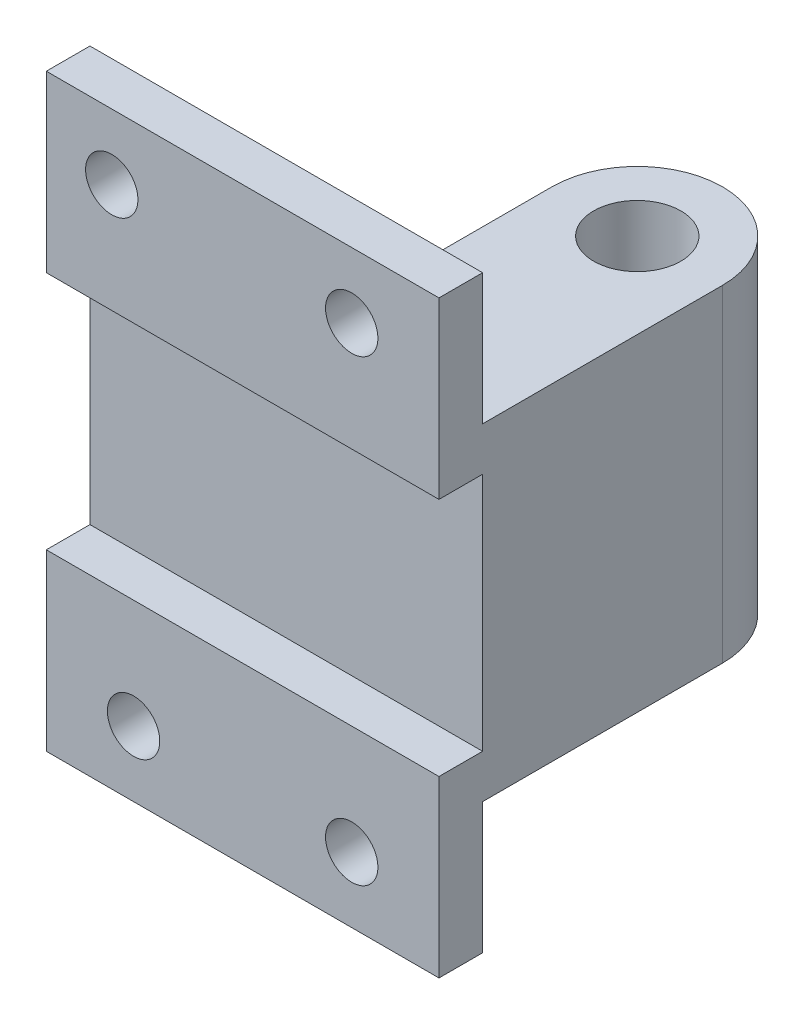
ISO-10303-21;
HEADER;
FILE_DESCRIPTION(('STEP AP214'),'2;1');
FILE_NAME('part.step','',(''),(''),'','','');
FILE_SCHEMA(('AUTOMOTIVE_DESIGN { 1 0 10303 214 1 1 1 1 }'));
ENDSEC;
DATA;
#1=APPLICATION_CONTEXT('core data for automotive mechanical design processes');
#2=APPLICATION_PROTOCOL_DEFINITION('international standard','automotive_design',2000,#1);
#3=PRODUCT_CONTEXT('',#1,'mechanical');
#4=PRODUCT('Part','Part','',(#3));
#5=PRODUCT_RELATED_PRODUCT_CATEGORY('part','',(#4));
#6=PRODUCT_DEFINITION_FORMATION('','',#4);
#7=PRODUCT_DEFINITION_CONTEXT('part definition',#1,'design');
#8=PRODUCT_DEFINITION('design','',#6,#7);
#9=PRODUCT_DEFINITION_SHAPE('','',#8);
#10=(LENGTH_UNIT() NAMED_UNIT(*) SI_UNIT(.MILLI.,.METRE.));
#11=(NAMED_UNIT(*) PLANE_ANGLE_UNIT() SI_UNIT($,.RADIAN.));
#12=(NAMED_UNIT(*) SI_UNIT($,.STERADIAN.) SOLID_ANGLE_UNIT());
#13=UNCERTAINTY_MEASURE_WITH_UNIT(LENGTH_MEASURE(1.E-05),#10,'distance_accuracy_value','');
#14=(GEOMETRIC_REPRESENTATION_CONTEXT(3) GLOBAL_UNCERTAINTY_ASSIGNED_CONTEXT((#13)) GLOBAL_UNIT_ASSIGNED_CONTEXT((#10,
#11,#12)) REPRESENTATION_CONTEXT('',''));
#15=CARTESIAN_POINT('',(0.,0.,0.));
#16=DIRECTION('',(0.,0.,1.));
#17=DIRECTION('',(1.,0.,0.));
#18=AXIS2_PLACEMENT_3D('',#15,#16,#17);
#19=CARTESIAN_POINT('',(50.0907088961746,73.,-21.471886497153));
#20=DIRECTION('',(-1.,0.,0.));
#21=DIRECTION('',(0.,0.,1.));
#22=AXIS2_PLACEMENT_3D('',#19,#20,#21);
#23=PLANE('',#22);
#24=DIRECTION('',(0.,0.,-1.));
#25=VECTOR('',#24,1.);
#26=CARTESIAN_POINT('',(50.0907088961746,67.,-21.471886497153));
#27=LINE('',#26,#25);
#28=CARTESIAN_POINT('',(50.0907088961746,67.,-20.));
#29=VERTEX_POINT('',#28);
#30=CARTESIAN_POINT('',(50.0907088961746,67.,-65.894352205504));
#31=VERTEX_POINT('',#30);
#32=EDGE_CURVE('E272',#29,#31,#27,.T.);
#33=ORIENTED_EDGE('',*,*,#32,.T.);
#34=DIRECTION('',(0.,-1.,0.));
#35=VECTOR('',#34,1.);
#36=CARTESIAN_POINT('',(50.0907088961746,73.,-65.894352205504));
#37=LINE('',#36,#35);
#38=CARTESIAN_POINT('',(50.0907088961746,73.,-65.894352205504));
#39=VERTEX_POINT('',#38);
#40=EDGE_CURVE('E44',#39,#31,#37,.T.);
#41=ORIENTED_EDGE('',*,*,#40,.F.);
#42=DIRECTION('',(0.,0.,-1.));
#43=VECTOR('',#42,1.);
#44=CARTESIAN_POINT('',(50.0907088961746,73.,-21.471886497153));
#45=LINE('',#44,#43);
#46=CARTESIAN_POINT('',(50.0907088961746,73.,-20.));
#47=VERTEX_POINT('',#46);
#48=EDGE_CURVE('E282',#47,#39,#45,.T.);
#49=ORIENTED_EDGE('',*,*,#48,.F.);
#50=DIRECTION('',(0.,-1.,0.));
#51=VECTOR('',#50,1.);
#52=CARTESIAN_POINT('',(50.0907088961746,73.,-20.));
#53=LINE('',#52,#51);
#54=EDGE_CURVE('E276',#47,#29,#53,.T.);
#55=ORIENTED_EDGE('',*,*,#54,.T.);
#56=EDGE_LOOP('',(#33,#41,#49,#55));
#57=FACE_BOUND('',#56,.T.);
#58=ADVANCED_FACE('F37',(#57),#23,.F.);
#59=CARTESIAN_POINT('',(65.7643904962565,73.,-65.894352205504));
#60=DIRECTION('',(0.,-1.,0.));
#61=DIRECTION('',(0.,0.,-1.));
#62=AXIS2_PLACEMENT_3D('',#59,#60,#61);
#63=PLANE('',#62);
#64=DIRECTION('',(-0.727333325582508,0.,0.686284367807609));
#65=VECTOR('',#64,1.);
#66=CARTESIAN_POINT('',(55.0399108357266,73.,-77.2602987759523));
#67=LINE('',#66,#65);
#68=CARTESIAN_POINT('',(54.159540176039,73.,-76.4296141360919));
#69=VERTEX_POINT('',#68);
#70=CARTESIAN_POINT('',(0.,73.,-25.3267092049918));
#71=VERTEX_POINT('',#70);
#72=EDGE_CURVE('E278',#69,#71,#67,.T.);
#73=ORIENTED_EDGE('',*,*,#72,.T.);
#74=DIRECTION('',(0.,0.,-1.));
#75=VECTOR('',#74,1.);
#76=CARTESIAN_POINT('',(0.,73.,-20.));
#77=LINE('',#76,#75);
#78=CARTESIAN_POINT('',(0.,73.,-20.));
#79=VERTEX_POINT('',#78);
#80=EDGE_CURVE('E51',#79,#71,#77,.T.);
#81=ORIENTED_EDGE('',*,*,#80,.F.);
#82=DIRECTION('',(-1.,0.,0.));
#83=VECTOR('',#82,1.);
#84=CARTESIAN_POINT('',(0.,73.,-20.));
#85=LINE('',#84,#83);
#86=EDGE_CURVE('E290',#47,#79,#85,.T.);
#87=ORIENTED_EDGE('',*,*,#86,.F.);
#88=ORIENTED_EDGE('',*,*,#48,.T.);
#89=CARTESIAN_POINT('',(65.7643904962565,73.,-65.894352205504));
#90=DIRECTION('',(0.,-1.,0.));
#91=DIRECTION('',(0.,0.,-1.));
#92=AXIS2_PLACEMENT_3D('',#89,#90,#91);
#93=CIRCLE('',#92,15.6736816000819);
#94=EDGE_CURVE('E281',#39,#69,#93,.T.);
#95=ORIENTED_EDGE('',*,*,#94,.T.);
#96=EDGE_LOOP('',(#73,#81,#87,#88,#95));
#97=FACE_BOUND('',#96,.T.);
#98=ADVANCED_FACE('F264',(#97),#63,.F.);
#99=CARTESIAN_POINT('',(65.7643904962565,67.,-65.894352205504));
#100=DIRECTION('',(0.,-1.,0.));
#101=DIRECTION('',(0.,0.,-1.));
#102=AXIS2_PLACEMENT_3D('',#99,#100,#101);
#103=PLANE('',#102);
#104=DIRECTION('',(0.,0.,-1.));
#105=VECTOR('',#104,1.);
#106=CARTESIAN_POINT('',(0.,67.,-20.));
#107=LINE('',#106,#105);
#108=CARTESIAN_POINT('',(0.,67.,-20.));
#109=VERTEX_POINT('',#108);
#110=CARTESIAN_POINT('',(0.,67.,-25.3267092049918));
#111=VERTEX_POINT('',#110);
#112=EDGE_CURVE('E236',#109,#111,#107,.T.);
#113=ORIENTED_EDGE('',*,*,#112,.T.);
#114=DIRECTION('',(-0.727333325582508,0.,0.686284367807609));
#115=VECTOR('',#114,1.);
#116=CARTESIAN_POINT('',(55.0399108357266,67.,-77.2602987759523));
#117=LINE('',#116,#115);
#118=CARTESIAN_POINT('',(54.159540176039,67.,-76.4296141360918));
#119=VERTEX_POINT('',#118);
#120=EDGE_CURVE('E11',#119,#111,#117,.T.);
#121=ORIENTED_EDGE('',*,*,#120,.F.);
#122=CARTESIAN_POINT('',(65.7643904962565,67.,-65.894352205504));
#123=DIRECTION('',(0.,-1.,0.));
#124=DIRECTION('',(0.,0.,-1.));
#125=AXIS2_PLACEMENT_3D('',#122,#123,#124);
#126=CIRCLE('',#125,15.6736816000819);
#127=EDGE_CURVE('E277',#31,#119,#126,.T.);
#128=ORIENTED_EDGE('',*,*,#127,.F.);
#129=ORIENTED_EDGE('',*,*,#32,.F.);
#130=DIRECTION('',(-1.,0.,0.));
#131=VECTOR('',#130,1.);
#132=CARTESIAN_POINT('',(0.,67.,-20.));
#133=LINE('',#132,#131);
#134=EDGE_CURVE('E241',#29,#109,#133,.T.);
#135=ORIENTED_EDGE('',*,*,#134,.T.);
#136=EDGE_LOOP('',(#113,#121,#128,#129,#135));
#137=FACE_BOUND('',#136,.T.);
#138=ADVANCED_FACE('F237',(#137),#103,.T.);
#139=CARTESIAN_POINT('',(65.7643904962565,73.,-65.894352205504));
#140=DIRECTION('',(0.,-1.,0.));
#141=DIRECTION('',(0.,0.,-1.));
#142=AXIS2_PLACEMENT_3D('',#139,#140,#141);
#143=CYLINDRICAL_SURFACE('',#142,15.6736816000819);
#144=ORIENTED_EDGE('',*,*,#127,.T.);
#145=DIRECTION('',(0.,-1.,0.));
#146=VECTOR('',#145,1.);
#147=CARTESIAN_POINT('',(54.159540176039,73.,-76.4296141360919));
#148=LINE('',#147,#146);
#149=EDGE_CURVE('E58',#119,#69,#148,.F.);
#150=ORIENTED_EDGE('',*,*,#149,.T.);
#151=ORIENTED_EDGE('',*,*,#94,.F.);
#152=ORIENTED_EDGE('',*,*,#40,.T.);
#153=EDGE_LOOP('',(#144,#150,#151,#152));
#154=FACE_BOUND('',#153,.T.);
#155=ADVANCED_FACE('F253',(#154),#143,.F.);
#156=CARTESIAN_POINT('',(55.9202814954141,85.,-78.0909834158128));
#157=DIRECTION('',(0.686284367807609,0.,0.727333325582508));
#158=DIRECTION('',(0.727333325582508,0.,-0.686284367807609));
#159=AXIS2_PLACEMENT_3D('',#156,#157,#158);
#160=PLANE('',#159);
#161=ORIENTED_EDGE('',*,*,#120,.T.);
#162=DIRECTION('',(0.,-1.,0.));
#163=VECTOR('',#162,1.);
#164=CARTESIAN_POINT('',(0.,73.,-25.3267092049918));
#165=LINE('',#164,#163);
#166=EDGE_CURVE('E246',#71,#111,#165,.T.);
#167=ORIENTED_EDGE('',*,*,#166,.F.);
#168=ORIENTED_EDGE('',*,*,#72,.F.);
#169=ORIENTED_EDGE('',*,*,#149,.F.);
#170=EDGE_LOOP('',(#161,#167,#168,#169));
#171=FACE_BOUND('',#170,.T.);
#172=ADVANCED_FACE('F251',(#171),#160,.F.);
#173=CARTESIAN_POINT('',(0.,73.,-20.));
#174=DIRECTION('',(-1.,0.,0.));
#175=DIRECTION('',(0.,0.,1.));
#176=AXIS2_PLACEMENT_3D('',#173,#174,#175);
#177=PLANE('',#176);
#178=DIRECTION('',(0.,1.,0.));
#179=VECTOR('',#178,1.);
#180=CARTESIAN_POINT('',(0.,105.,-20.));
#181=LINE('',#180,#179);
#182=CARTESIAN_POINT('',(0.,105.,-20.));
#183=VERTEX_POINT('',#182);
#184=EDGE_CURVE('E434',#79,#183,#181,.T.);
#185=ORIENTED_EDGE('',*,*,#184,.F.);
#186=ORIENTED_EDGE('',*,*,#80,.T.);
#187=ORIENTED_EDGE('',*,*,#166,.T.);
#188=ORIENTED_EDGE('',*,*,#112,.F.);
#189=CARTESIAN_POINT('',(0.,30.,-20.));
#190=VERTEX_POINT('',#189);
#191=EDGE_CURVE('E400',#190,#109,#181,.T.);
#192=ORIENTED_EDGE('',*,*,#191,.F.);
#193=DIRECTION('',(0.,0.,-1.));
#194=VECTOR('',#193,1.);
#195=CARTESIAN_POINT('',(0.,30.,-20.));
#196=LINE('',#195,#194);
#197=CARTESIAN_POINT('',(0.,30.,-10.));
#198=VERTEX_POINT('',#197);
#199=EDGE_CURVE('E429',#198,#190,#196,.T.);
#200=ORIENTED_EDGE('',*,*,#199,.F.);
#201=DIRECTION('',(0.,-1.,0.));
#202=VECTOR('',#201,1.);
#203=CARTESIAN_POINT('',(0.,135.,-10.));
#204=LINE('',#203,#202);
#205=CARTESIAN_POINT('',(0.,0.,-10.));
#206=VERTEX_POINT('',#205);
#207=EDGE_CURVE('E461',#198,#206,#204,.T.);
#208=ORIENTED_EDGE('',*,*,#207,.T.);
#209=DIRECTION('',(0.,0.,1.));
#210=VECTOR('',#209,1.);
#211=CARTESIAN_POINT('',(0.,0.,0.));
#212=LINE('',#211,#210);
#213=CARTESIAN_POINT('',(0.,0.,0.));
#214=VERTEX_POINT('',#213);
#215=EDGE_CURVE('E411',#206,#214,#212,.T.);
#216=ORIENTED_EDGE('',*,*,#215,.T.);
#217=DIRECTION('',(0.,-1.,0.));
#218=VECTOR('',#217,1.);
#219=CARTESIAN_POINT('',(0.,135.,0.));
#220=LINE('',#219,#218);
#221=CARTESIAN_POINT('',(0.,40.,0.));
#222=VERTEX_POINT('',#221);
#223=EDGE_CURVE('E418',#222,#214,#220,.T.);
#224=ORIENTED_EDGE('',*,*,#223,.F.);
#225=DIRECTION('',(0.,0.,-1.));
#226=VECTOR('',#225,1.);
#227=CARTESIAN_POINT('',(0.,40.,0.));
#228=LINE('',#227,#226);
#229=CARTESIAN_POINT('',(0.,40.,-10.));
#230=VERTEX_POINT('',#229);
#231=EDGE_CURVE('E408',#222,#230,#228,.T.);
#232=ORIENTED_EDGE('',*,*,#231,.T.);
#233=DIRECTION('',(0.,1.,0.));
#234=VECTOR('',#233,1.);
#235=CARTESIAN_POINT('',(0.,0.,-10.));
#236=LINE('',#235,#234);
#237=CARTESIAN_POINT('',(0.,95.,-10.));
#238=VERTEX_POINT('',#237);
#239=EDGE_CURVE('E361',#230,#238,#236,.T.);
#240=ORIENTED_EDGE('',*,*,#239,.T.);
#241=DIRECTION('',(0.,0.,1.));
#242=VECTOR('',#241,1.);
#243=CARTESIAN_POINT('',(0.,95.,0.));
#244=LINE('',#243,#242);
#245=CARTESIAN_POINT('',(0.,95.,0.));
#246=VERTEX_POINT('',#245);
#247=EDGE_CURVE('E401',#238,#246,#244,.T.);
#248=ORIENTED_EDGE('',*,*,#247,.T.);
#249=CARTESIAN_POINT('',(0.,135.,0.));
#250=VERTEX_POINT('',#249);
#251=EDGE_CURVE('E357',#250,#246,#220,.T.);
#252=ORIENTED_EDGE('',*,*,#251,.F.);
#253=DIRECTION('',(0.,0.,1.));
#254=VECTOR('',#253,1.);
#255=CARTESIAN_POINT('',(0.,135.,0.));
#256=LINE('',#255,#254);
#257=CARTESIAN_POINT('',(0.,135.,-10.));
#258=VERTEX_POINT('',#257);
#259=EDGE_CURVE('E450',#258,#250,#256,.T.);
#260=ORIENTED_EDGE('',*,*,#259,.F.);
#261=CARTESIAN_POINT('',(0.,105.,-10.));
#262=VERTEX_POINT('',#261);
#263=EDGE_CURVE('E404',#258,#262,#204,.T.);
#264=ORIENTED_EDGE('',*,*,#263,.T.);
#265=DIRECTION('',(0.,0.,1.));
#266=VECTOR('',#265,1.);
#267=CARTESIAN_POINT('',(0.,105.,-10.));
#268=LINE('',#267,#266);
#269=EDGE_CURVE('E383',#183,#262,#268,.T.);
#270=ORIENTED_EDGE('',*,*,#269,.F.);
#271=EDGE_LOOP('',(#185,#186,#187,#188,#192,#200,#208,#216,#224,#232,#240,#248,#252,#260,#264,#270));
#272=FACE_BOUND('',#271,.T.);
#273=ADVANCED_FACE('F247',(#272),#177,.T.);
#274=CARTESIAN_POINT('',(90.,105.,-20.));
#275=DIRECTION('',(0.,0.,1.));
#276=DIRECTION('',(0.,-1.,0.));
#277=AXIS2_PLACEMENT_3D('',#274,#275,#276);
#278=PLANE('',#277);
#279=ORIENTED_EDGE('',*,*,#54,.F.);
#280=ORIENTED_EDGE('',*,*,#86,.T.);
#281=ORIENTED_EDGE('',*,*,#184,.T.);
#282=DIRECTION('',(-1.,0.,0.));
#283=VECTOR('',#282,1.);
#284=CARTESIAN_POINT('',(90.,105.,-20.));
#285=LINE('',#284,#283);
#286=CARTESIAN_POINT('',(39.,105.,-20.));
#287=VERTEX_POINT('',#286);
#288=EDGE_CURVE('E380',#287,#183,#285,.T.);
#289=ORIENTED_EDGE('',*,*,#288,.F.);
#290=DIRECTION('',(-1.,0.,0.));
#291=VECTOR('',#290,1.);
#292=CARTESIAN_POINT('',(69.,105.,-20.));
#293=LINE('',#292,#291);
#294=CARTESIAN_POINT('',(45.,105.,-20.));
#295=VERTEX_POINT('',#294);
#296=EDGE_CURVE('E508',#295,#287,#293,.T.);
#297=ORIENTED_EDGE('',*,*,#296,.F.);
#298=CARTESIAN_POINT('',(50.8916646431351,105.,-20.));
#299=VERTEX_POINT('',#298);
#300=EDGE_CURVE('E442',#299,#295,#285,.T.);
#301=ORIENTED_EDGE('',*,*,#300,.F.);
#302=DIRECTION('',(0.,-1.,0.));
#303=VECTOR('',#302,1.);
#304=CARTESIAN_POINT('',(50.8916646431351,105.,-20.));
#305=LINE('',#304,#303);
#306=CARTESIAN_POINT('',(50.8916646431351,30.,-20.));
#307=VERTEX_POINT('',#306);
#308=EDGE_CURVE('E396',#299,#307,#305,.T.);
#309=ORIENTED_EDGE('',*,*,#308,.T.);
#310=DIRECTION('',(-1.,0.,0.));
#311=VECTOR('',#310,1.);
#312=CARTESIAN_POINT('',(90.,30.,-20.));
#313=LINE('',#312,#311);
#314=CARTESIAN_POINT('',(45.,30.,-20.));
#315=VERTEX_POINT('',#314);
#316=EDGE_CURVE('E325',#307,#315,#313,.T.);
#317=ORIENTED_EDGE('',*,*,#316,.T.);
#318=DIRECTION('',(-1.,0.,0.));
#319=VECTOR('',#318,1.);
#320=CARTESIAN_POINT('',(69.,30.,-20.));
#321=LINE('',#320,#319);
#322=CARTESIAN_POINT('',(39.,30.,-20.));
#323=VERTEX_POINT('',#322);
#324=EDGE_CURVE('E321',#315,#323,#321,.T.);
#325=ORIENTED_EDGE('',*,*,#324,.T.);
#326=EDGE_CURVE('E324',#323,#190,#313,.T.);
#327=ORIENTED_EDGE('',*,*,#326,.T.);
#328=ORIENTED_EDGE('',*,*,#191,.T.);
#329=ORIENTED_EDGE('',*,*,#134,.F.);
#330=EDGE_LOOP('',(#279,#280,#281,#289,#297,#301,#309,#317,#325,#327,#328,#329));
#331=FACE_BOUND('',#330,.T.);
#332=ADVANCED_FACE('F259',(#331),#278,.F.);
#333=CARTESIAN_POINT('',(0.,135.,-10.));
#334=DIRECTION('',(0.,0.,1.));
#335=DIRECTION('',(1.,0.,0.));
#336=AXIS2_PLACEMENT_3D('',#333,#334,#335);
#337=PLANE('',#336);
#338=CARTESIAN_POINT('',(15.,120.,-10.));
#339=DIRECTION('',(0.,0.,-1.));
#340=DIRECTION('',(-1.,0.,0.));
#341=AXIS2_PLACEMENT_3D('',#338,#339,#340);
#342=CIRCLE('',#341,6.);
#343=CARTESIAN_POINT('',(8.99999999999999,120.,-10.));
#344=VERTEX_POINT('',#343);
#345=EDGE_CURVE('E350',#344,#344,#342,.T.);
#346=ORIENTED_EDGE('',*,*,#345,.F.);
#347=EDGE_LOOP('',(#346));
#348=FACE_BOUND('',#347,.T.);
#349=DIRECTION('',(0.,-1.,0.));
#350=VECTOR('',#349,1.);
#351=CARTESIAN_POINT('',(39.,135.,-10.));
#352=LINE('',#351,#350);
#353=CARTESIAN_POINT('',(39.,135.,-10.));
#354=VERTEX_POINT('',#353);
#355=CARTESIAN_POINT('',(39.,105.,-10.));
#356=VERTEX_POINT('',#355);
#357=EDGE_CURVE('E310',#354,#356,#352,.T.);
#358=ORIENTED_EDGE('',*,*,#357,.T.);
#359=DIRECTION('',(-1.,0.,0.));
#360=VECTOR('',#359,1.);
#361=CARTESIAN_POINT('',(90.,105.,-10.));
#362=LINE('',#361,#360);
#363=EDGE_CURVE('E441',#356,#262,#362,.T.);
#364=ORIENTED_EDGE('',*,*,#363,.T.);
#365=ORIENTED_EDGE('',*,*,#263,.F.);
#366=DIRECTION('',(-1.,0.,0.));
#367=VECTOR('',#366,1.);
#368=CARTESIAN_POINT('',(0.,135.,-10.));
#369=LINE('',#368,#367);
#370=EDGE_CURVE('E457',#354,#258,#369,.T.);
#371=ORIENTED_EDGE('',*,*,#370,.F.);
#372=EDGE_LOOP('',(#358,#364,#365,#371));
#373=FACE_BOUND('',#372,.T.);
#374=ADVANCED_FACE('F526',(#348,#373),#337,.F.);
#375=CARTESIAN_POINT('',(70.,120.,-10.));
#376=DIRECTION('',(0.,0.,-1.));
#377=DIRECTION('',(-1.,0.,0.));
#378=AXIS2_PLACEMENT_3D('',#375,#376,#377);
#379=CIRCLE('',#378,6.);
#380=CARTESIAN_POINT('',(64.,120.,-10.));
#381=VERTEX_POINT('',#380);
#382=EDGE_CURVE('E341',#381,#381,#379,.T.);
#383=ORIENTED_EDGE('',*,*,#382,.F.);
#384=EDGE_LOOP('',(#383));
#385=FACE_BOUND('',#384,.T.);
#386=DIRECTION('',(0.,-1.,0.));
#387=VECTOR('',#386,1.);
#388=CARTESIAN_POINT('',(45.,135.,-10.));
#389=LINE('',#388,#387);
#390=CARTESIAN_POINT('',(45.,135.,-10.));
#391=VERTEX_POINT('',#390);
#392=CARTESIAN_POINT('',(45.,105.,-10.));
#393=VERTEX_POINT('',#392);
#394=EDGE_CURVE('E498',#391,#393,#389,.T.);
#395=ORIENTED_EDGE('',*,*,#394,.F.);
#396=CARTESIAN_POINT('',(90.,135.,-10.));
#397=VERTEX_POINT('',#396);
#398=EDGE_CURVE('E447',#397,#391,#369,.T.);
#399=ORIENTED_EDGE('',*,*,#398,.F.);
#400=DIRECTION('',(0.,-1.,0.));
#401=VECTOR('',#400,1.);
#402=CARTESIAN_POINT('',(90.,135.,-10.));
#403=LINE('',#402,#401);
#404=CARTESIAN_POINT('',(90.,105.,-10.));
#405=VERTEX_POINT('',#404);
#406=EDGE_CURVE('E440',#397,#405,#403,.T.);
#407=ORIENTED_EDGE('',*,*,#406,.T.);
#408=EDGE_CURVE('E437',#405,#393,#362,.T.);
#409=ORIENTED_EDGE('',*,*,#408,.T.);
#410=EDGE_LOOP('',(#395,#399,#407,#409));
#411=FACE_BOUND('',#410,.T.);
#412=ADVANCED_FACE('F549',(#385,#411),#337,.F.);
#413=CARTESIAN_POINT('',(90.,105.,-10.));
#414=DIRECTION('',(0.,-1.,0.));
#415=DIRECTION('',(0.,0.,-1.));
#416=AXIS2_PLACEMENT_3D('',#413,#414,#415);
#417=PLANE('',#416);
#418=DIRECTION('',(0.,0.,1.));
#419=VECTOR('',#418,1.);
#420=CARTESIAN_POINT('',(39.,105.,-20.));
#421=LINE('',#420,#419);
#422=EDGE_CURVE('E504',#287,#356,#421,.T.);
#423=ORIENTED_EDGE('',*,*,#422,.F.);
#424=ORIENTED_EDGE('',*,*,#288,.T.);
#425=ORIENTED_EDGE('',*,*,#269,.T.);
#426=ORIENTED_EDGE('',*,*,#363,.F.);
#427=EDGE_LOOP('',(#423,#424,#425,#426));
#428=FACE_BOUND('',#427,.T.);
#429=ADVANCED_FACE('F533',(#428),#417,.F.);
#430=DIRECTION('',(0.,0.,1.));
#431=VECTOR('',#430,1.);
#432=CARTESIAN_POINT('',(50.8916646431351,105.,-65.));
#433=LINE('',#432,#431);
#434=CARTESIAN_POINT('',(50.8916646431351,105.,-65.));
#435=VERTEX_POINT('',#434);
#436=EDGE_CURVE('E378',#435,#299,#433,.T.);
#437=ORIENTED_EDGE('',*,*,#436,.T.);
#438=ORIENTED_EDGE('',*,*,#300,.T.);
#439=DIRECTION('',(0.,0.,-1.));
#440=VECTOR('',#439,1.);
#441=CARTESIAN_POINT('',(45.,105.,-20.));
#442=LINE('',#441,#440);
#443=EDGE_CURVE('E501',#393,#295,#442,.T.);
#444=ORIENTED_EDGE('',*,*,#443,.F.);
#445=ORIENTED_EDGE('',*,*,#408,.F.);
#446=DIRECTION('',(0.,0.,1.));
#447=VECTOR('',#446,1.);
#448=CARTESIAN_POINT('',(90.,105.,-10.));
#449=LINE('',#448,#447);
#450=CARTESIAN_POINT('',(90.,105.,-65.));
#451=VERTEX_POINT('',#450);
#452=EDGE_CURVE('E425',#451,#405,#449,.T.);
#453=ORIENTED_EDGE('',*,*,#452,.F.);
#454=CARTESIAN_POINT('',(70.4458323215675,105.,-65.));
#455=DIRECTION('',(0.,1.,0.));
#456=DIRECTION('',(0.,0.,1.));
#457=AXIS2_PLACEMENT_3D('',#454,#455,#456);
#458=CIRCLE('',#457,19.5541676784325);
#459=EDGE_CURVE('E381',#451,#435,#458,.T.);
#460=ORIENTED_EDGE('',*,*,#459,.T.);
#461=EDGE_LOOP('',(#437,#438,#444,#445,#453,#460));
#462=FACE_BOUND('',#461,.T.);
#463=CARTESIAN_POINT('',(70.4458323215675,105.,-65.));
#464=DIRECTION('',(0.,-1.,0.));
#465=DIRECTION('',(0.,0.,-1.));
#466=AXIS2_PLACEMENT_3D('',#463,#464,#465);
#467=CIRCLE('',#466,9.99999999999999);
#468=CARTESIAN_POINT('',(70.4458323215675,105.,-75.));
#469=VERTEX_POINT('',#468);
#470=EDGE_CURVE('E399',#469,#469,#467,.T.);
#471=ORIENTED_EDGE('',*,*,#470,.T.);
#472=EDGE_LOOP('',(#471));
#473=FACE_BOUND('',#472,.T.);
#474=ADVANCED_FACE('F555',(#462,#473),#417,.F.);
#475=CARTESIAN_POINT('',(65.7643904962565,73.,-65.894352205504));
#476=DIRECTION('',(0.,-1.,0.));
#477=DIRECTION('',(0.,0.,-1.));
#478=AXIS2_PLACEMENT_3D('',#475,#476,#477);
#479=PLANE('',#478);
#480=DIRECTION('',(-1.,0.,0.));
#481=VECTOR('',#480,1.);
#482=CARTESIAN_POINT('',(56.5789310412015,73.,-78.5944163588965));
#483=LINE('',#482,#481);
#484=CARTESIAN_POINT('',(56.3903238833352,73.,-78.5944163588965));
#485=VERTEX_POINT('',#484);
#486=CARTESIAN_POINT('',(55.9202814954141,73.,-78.5944163588965));
#487=VERTEX_POINT('',#486);
#488=EDGE_CURVE('E307',#485,#487,#483,.T.);
#489=ORIENTED_EDGE('',*,*,#488,.T.);
#490=DIRECTION('',(0.,0.,1.));
#491=VECTOR('',#490,1.);
#492=CARTESIAN_POINT('',(55.9202814954141,73.,-65.894352205504));
#493=LINE('',#492,#491);
#494=CARTESIAN_POINT('',(55.9202814954141,73.,-78.0909834158128));
#495=VERTEX_POINT('',#494);
#496=EDGE_CURVE('E303',#487,#495,#493,.T.);
#497=ORIENTED_EDGE('',*,*,#496,.T.);
#498=CARTESIAN_POINT('',(70.4458323215675,73.,-65.));
#499=DIRECTION('',(0.,-1.,0.));
#500=DIRECTION('',(0.,0.,-1.));
#501=AXIS2_PLACEMENT_3D('',#498,#499,#500);
#502=CIRCLE('',#501,19.5541676784325);
#503=EDGE_CURVE('E306',#495,#485,#502,.T.);
#504=ORIENTED_EDGE('',*,*,#503,.T.);
#505=EDGE_LOOP('',(#489,#497,#504));
#506=FACE_BOUND('',#505,.T.);
#507=ADVANCED_FACE('F639',(#506),#479,.F.);
#508=CARTESIAN_POINT('',(65.7643904962565,67.,-65.894352205504));
#509=DIRECTION('',(0.,-1.,0.));
#510=DIRECTION('',(0.,0.,-1.));
#511=AXIS2_PLACEMENT_3D('',#508,#509,#510);
#512=PLANE('',#511);
#513=DIRECTION('',(0.,0.,1.));
#514=VECTOR('',#513,1.);
#515=CARTESIAN_POINT('',(55.9202814954141,67.,-65.894352205504));
#516=LINE('',#515,#514);
#517=CARTESIAN_POINT('',(55.9202814954141,67.,-78.5944163588965));
#518=VERTEX_POINT('',#517);
#519=CARTESIAN_POINT('',(55.9202814954141,67.,-78.0909834158128));
#520=VERTEX_POINT('',#519);
#521=EDGE_CURVE('E493',#518,#520,#516,.T.);
#522=ORIENTED_EDGE('',*,*,#521,.F.);
#523=DIRECTION('',(-1.,0.,0.));
#524=VECTOR('',#523,1.);
#525=CARTESIAN_POINT('',(56.5789310412015,67.,-78.5944163588965));
#526=LINE('',#525,#524);
#527=CARTESIAN_POINT('',(56.3903238833352,67.,-78.5944163588965));
#528=VERTEX_POINT('',#527);
#529=EDGE_CURVE('E302',#528,#518,#526,.T.);
#530=ORIENTED_EDGE('',*,*,#529,.F.);
#531=CARTESIAN_POINT('',(70.4458323215675,67.,-65.));
#532=DIRECTION('',(0.,-1.,0.));
#533=DIRECTION('',(0.,0.,-1.));
#534=AXIS2_PLACEMENT_3D('',#531,#532,#533);
#535=CIRCLE('',#534,19.5541676784325);
#536=EDGE_CURVE('E390',#520,#528,#535,.T.);
#537=ORIENTED_EDGE('',*,*,#536,.F.);
#538=EDGE_LOOP('',(#522,#530,#537));
#539=FACE_BOUND('',#538,.T.);
#540=ADVANCED_FACE('F642',(#539),#512,.T.);
#541=CARTESIAN_POINT('',(70.4458323215675,105.,-65.));
#542=DIRECTION('',(0.,-1.,0.));
#543=DIRECTION('',(0.,0.,-1.));
#544=AXIS2_PLACEMENT_3D('',#541,#542,#543);
#545=CYLINDRICAL_SURFACE('',#544,19.5541676784325);
#546=ORIENTED_EDGE('',*,*,#503,.F.);
#547=DIRECTION('',(0.,-1.,0.));
#548=VECTOR('',#547,1.);
#549=CARTESIAN_POINT('',(55.9202814954141,70.,-78.0909834158128));
#550=LINE('',#549,#548);
#551=EDGE_CURVE('E297',#520,#495,#550,.F.);
#552=ORIENTED_EDGE('',*,*,#551,.F.);
#553=ORIENTED_EDGE('',*,*,#536,.T.);
#554=DIRECTION('',(0.,-1.,0.));
#555=VECTOR('',#554,1.);
#556=CARTESIAN_POINT('',(56.3903238833352,105.,-78.5944163588965));
#557=LINE('',#556,#555);
#558=EDGE_CURVE('E301',#485,#528,#557,.T.);
#559=ORIENTED_EDGE('',*,*,#558,.F.);
#560=EDGE_LOOP('',(#546,#552,#553,#559));
#561=FACE_BOUND('',#560,.T.);
#562=CARTESIAN_POINT('',(70.4458323215675,30.,-65.));
#563=DIRECTION('',(0.,1.,0.));
#564=DIRECTION('',(0.,0.,1.));
#565=AXIS2_PLACEMENT_3D('',#562,#563,#564);
#566=CIRCLE('',#565,19.5541676784325);
#567=CARTESIAN_POINT('',(90.,30.,-65.));
#568=VERTEX_POINT('',#567);
#569=CARTESIAN_POINT('',(50.8916646431351,30.,-65.));
#570=VERTEX_POINT('',#569);
#571=EDGE_CURVE('E387',#568,#570,#566,.T.);
#572=ORIENTED_EDGE('',*,*,#571,.T.);
#573=DIRECTION('',(0.,-1.,0.));
#574=VECTOR('',#573,1.);
#575=CARTESIAN_POINT('',(50.8916646431351,105.,-65.));
#576=LINE('',#575,#574);
#577=EDGE_CURVE('E377',#435,#570,#576,.T.);
#578=ORIENTED_EDGE('',*,*,#577,.F.);
#579=ORIENTED_EDGE('',*,*,#459,.F.);
#580=DIRECTION('',(0.,-1.,0.));
#581=VECTOR('',#580,1.);
#582=CARTESIAN_POINT('',(90.,105.,-65.));
#583=LINE('',#582,#581);
#584=EDGE_CURVE('E389',#451,#568,#583,.T.);
#585=ORIENTED_EDGE('',*,*,#584,.T.);
#586=EDGE_LOOP('',(#572,#578,#579,#585));
#587=FACE_BOUND('',#586,.T.);
#588=ADVANCED_FACE('F645',(#561,#587),#545,.T.);
#589=CARTESIAN_POINT('',(0.,0.,0.));
#590=DIRECTION('',(0.,-1.,0.));
#591=DIRECTION('',(0.,0.,-1.));
#592=AXIS2_PLACEMENT_3D('',#589,#590,#591);
#593=PLANE('',#592);
#594=DIRECTION('',(-1.,0.,0.));
#595=VECTOR('',#594,1.);
#596=CARTESIAN_POINT('',(0.,0.,-9.97571448149712));
#597=LINE('',#596,#595);
#598=CARTESIAN_POINT('',(69.,0.,-9.97571448149713));
#599=VERTEX_POINT('',#598);
#600=CARTESIAN_POINT('',(39.,0.,-9.97571448149713));
#601=VERTEX_POINT('',#600);
#602=EDGE_CURVE('E331',#599,#601,#597,.T.);
#603=ORIENTED_EDGE('',*,*,#602,.F.);
#604=DIRECTION('',(0.,0.,-1.));
#605=VECTOR('',#604,1.);
#606=CARTESIAN_POINT('',(69.,0.,0.));
#607=LINE('',#606,#605);
#608=CARTESIAN_POINT('',(69.,0.,-10.));
#609=VERTEX_POINT('',#608);
#610=EDGE_CURVE('E395',#599,#609,#607,.T.);
#611=ORIENTED_EDGE('',*,*,#610,.T.);
#612=DIRECTION('',(-1.,0.,0.));
#613=VECTOR('',#612,1.);
#614=CARTESIAN_POINT('',(0.,0.,-10.));
#615=LINE('',#614,#613);
#616=CARTESIAN_POINT('',(90.,0.,-10.));
#617=VERTEX_POINT('',#616);
#618=EDGE_CURVE('E468',#617,#609,#615,.T.);
#619=ORIENTED_EDGE('',*,*,#618,.F.);
#620=DIRECTION('',(0.,0.,-1.));
#621=VECTOR('',#620,1.);
#622=CARTESIAN_POINT('',(90.,0.,0.));
#623=LINE('',#622,#621);
#624=CARTESIAN_POINT('',(90.,0.,0.));
#625=VERTEX_POINT('',#624);
#626=EDGE_CURVE('E426',#625,#617,#623,.T.);
#627=ORIENTED_EDGE('',*,*,#626,.F.);
#628=DIRECTION('',(1.,0.,0.));
#629=VECTOR('',#628,1.);
#630=CARTESIAN_POINT('',(0.,0.,0.));
#631=LINE('',#630,#629);
#632=EDGE_CURVE('E462',#214,#625,#631,.T.);
#633=ORIENTED_EDGE('',*,*,#632,.F.);
#634=ORIENTED_EDGE('',*,*,#215,.F.);
#635=CARTESIAN_POINT('',(39.,0.,-10.));
#636=VERTEX_POINT('',#635);
#637=EDGE_CURVE('E330',#636,#206,#615,.T.);
#638=ORIENTED_EDGE('',*,*,#637,.F.);
#639=DIRECTION('',(0.,0.,-1.));
#640=VECTOR('',#639,1.);
#641=CARTESIAN_POINT('',(39.,0.,0.));
#642=LINE('',#641,#640);
#643=EDGE_CURVE('E317',#601,#636,#642,.T.);
#644=ORIENTED_EDGE('',*,*,#643,.F.);
#645=EDGE_LOOP('',(#603,#611,#619,#627,#633,#634,#638,#644));
#646=FACE_BOUND('',#645,.T.);
#647=ADVANCED_FACE('F585',(#646),#593,.T.);
#648=CARTESIAN_POINT('',(20.,15.,-10.));
#649=DIRECTION('',(0.,0.,-1.));
#650=DIRECTION('',(-1.,0.,0.));
#651=AXIS2_PLACEMENT_3D('',#648,#649,#650);
#652=CIRCLE('',#651,6.);
#653=CARTESIAN_POINT('',(14.,15.,-10.));
#654=VERTEX_POINT('',#653);
#655=EDGE_CURVE('E364',#654,#654,#652,.T.);
#656=ORIENTED_EDGE('',*,*,#655,.F.);
#657=EDGE_LOOP('',(#656));
#658=FACE_BOUND('',#657,.T.);
#659=DIRECTION('',(0.,1.,0.));
#660=VECTOR('',#659,1.);
#661=CARTESIAN_POINT('',(39.,0.,-10.));
#662=LINE('',#661,#660);
#663=CARTESIAN_POINT('',(39.,0.0726800482429811,-10.));
#664=VERTEX_POINT('',#663);
#665=EDGE_CURVE('E333',#636,#664,#662,.T.);
#666=ORIENTED_EDGE('',*,*,#665,.F.);
#667=ORIENTED_EDGE('',*,*,#637,.T.);
#668=ORIENTED_EDGE('',*,*,#207,.F.);
#669=DIRECTION('',(-1.,0.,0.));
#670=VECTOR('',#669,1.);
#671=CARTESIAN_POINT('',(90.,30.,-10.));
#672=LINE('',#671,#670);
#673=CARTESIAN_POINT('',(39.,30.,-10.));
#674=VERTEX_POINT('',#673);
#675=EDGE_CURVE('E432',#674,#198,#672,.T.);
#676=ORIENTED_EDGE('',*,*,#675,.F.);
#677=EDGE_CURVE('E340',#664,#674,#662,.T.);
#678=ORIENTED_EDGE('',*,*,#677,.F.);
#679=EDGE_LOOP('',(#666,#667,#668,#676,#678));
#680=FACE_BOUND('',#679,.T.);
#681=ADVANCED_FACE('F597',(#658,#680),#337,.F.);
#682=CARTESIAN_POINT('',(70.,15.,-10.));
#683=DIRECTION('',(0.,0.,-1.));
#684=DIRECTION('',(-1.,0.,0.));
#685=AXIS2_PLACEMENT_3D('',#682,#683,#684);
#686=CIRCLE('',#685,6.);
#687=CARTESIAN_POINT('',(64.,15.,-10.));
#688=VERTEX_POINT('',#687);
#689=EDGE_CURVE('E353',#688,#688,#686,.T.);
#690=ORIENTED_EDGE('',*,*,#689,.F.);
#691=EDGE_LOOP('',(#690));
#692=FACE_BOUND('',#691,.T.);
#693=DIRECTION('',(0.,-1.,0.));
#694=VECTOR('',#693,1.);
#695=CARTESIAN_POINT('',(69.,135.,-10.));
#696=LINE('',#695,#694);
#697=CARTESIAN_POINT('',(69.,0.0726800482429291,-9.99999999999999));
#698=VERTEX_POINT('',#697);
#699=EDGE_CURVE('E318',#698,#609,#696,.T.);
#700=ORIENTED_EDGE('',*,*,#699,.F.);
#701=DIRECTION('',(-1.,0.,0.));
#702=VECTOR('',#701,1.);
#703=CARTESIAN_POINT('',(0.,0.0726800482429568,-10.));
#704=LINE('',#703,#702);
#705=CARTESIAN_POINT('',(45.,0.072680048242983,-10.));
#706=VERTEX_POINT('',#705);
#707=EDGE_CURVE('E326',#698,#706,#704,.T.);
#708=ORIENTED_EDGE('',*,*,#707,.T.);
#709=DIRECTION('',(0.,1.,0.));
#710=VECTOR('',#709,1.);
#711=CARTESIAN_POINT('',(45.,0.,-10.));
#712=LINE('',#711,#710);
#713=CARTESIAN_POINT('',(45.,30.,-10.));
#714=VERTEX_POINT('',#713);
#715=EDGE_CURVE('E329',#706,#714,#712,.T.);
#716=ORIENTED_EDGE('',*,*,#715,.T.);
#717=CARTESIAN_POINT('',(90.,30.,-10.));
#718=VERTEX_POINT('',#717);
#719=EDGE_CURVE('E405',#718,#714,#672,.T.);
#720=ORIENTED_EDGE('',*,*,#719,.F.);
#721=EDGE_CURVE('E346',#718,#617,#403,.T.);
#722=ORIENTED_EDGE('',*,*,#721,.T.);
#723=ORIENTED_EDGE('',*,*,#618,.T.);
#724=EDGE_LOOP('',(#700,#708,#716,#720,#722,#723));
#725=FACE_BOUND('',#724,.T.);
#726=ADVANCED_FACE('F579',(#692,#725),#337,.F.);
#727=CARTESIAN_POINT('',(90.,30.,-20.));
#728=DIRECTION('',(0.,1.,0.));
#729=DIRECTION('',(0.,0.,1.));
#730=AXIS2_PLACEMENT_3D('',#727,#728,#729);
#731=PLANE('',#730);
#732=DIRECTION('',(0.,0.,-1.));
#733=VECTOR('',#732,1.);
#734=CARTESIAN_POINT('',(39.,30.,-20.));
#735=LINE('',#734,#733);
#736=EDGE_CURVE('E337',#674,#323,#735,.T.);
#737=ORIENTED_EDGE('',*,*,#736,.F.);
#738=ORIENTED_EDGE('',*,*,#675,.T.);
#739=ORIENTED_EDGE('',*,*,#199,.T.);
#740=ORIENTED_EDGE('',*,*,#326,.F.);
#741=EDGE_LOOP('',(#737,#738,#739,#740));
#742=FACE_BOUND('',#741,.T.);
#743=ADVANCED_FACE('F607',(#742),#731,.F.);
#744=ORIENTED_EDGE('',*,*,#316,.F.);
#745=DIRECTION('',(0.,0.,1.));
#746=VECTOR('',#745,1.);
#747=CARTESIAN_POINT('',(50.8916646431351,30.,-65.));
#748=LINE('',#747,#746);
#749=EDGE_CURVE('E384',#570,#307,#748,.T.);
#750=ORIENTED_EDGE('',*,*,#749,.F.);
#751=ORIENTED_EDGE('',*,*,#571,.F.);
#752=DIRECTION('',(0.,0.,-1.));
#753=VECTOR('',#752,1.);
#754=CARTESIAN_POINT('',(90.,30.,-20.));
#755=LINE('',#754,#753);
#756=EDGE_CURVE('E423',#718,#568,#755,.T.);
#757=ORIENTED_EDGE('',*,*,#756,.F.);
#758=ORIENTED_EDGE('',*,*,#719,.T.);
#759=DIRECTION('',(0.,0.,1.));
#760=VECTOR('',#759,1.);
#761=CARTESIAN_POINT('',(45.,30.,-10.));
#762=LINE('',#761,#760);
#763=EDGE_CURVE('E336',#315,#714,#762,.T.);
#764=ORIENTED_EDGE('',*,*,#763,.F.);
#765=EDGE_LOOP('',(#744,#750,#751,#757,#758,#764));
#766=FACE_BOUND('',#765,.T.);
#767=CARTESIAN_POINT('',(70.4458323215675,30.,-65.));
#768=DIRECTION('',(0.,-1.,0.));
#769=DIRECTION('',(0.,0.,-1.));
#770=AXIS2_PLACEMENT_3D('',#767,#768,#769);
#771=CIRCLE('',#770,9.99999999999999);
#772=CARTESIAN_POINT('',(70.4458323215675,30.,-75.));
#773=VERTEX_POINT('',#772);
#774=EDGE_CURVE('E367',#773,#773,#771,.T.);
#775=ORIENTED_EDGE('',*,*,#774,.F.);
#776=EDGE_LOOP('',(#775));
#777=FACE_BOUND('',#776,.T.);
#778=ADVANCED_FACE('F567',(#766,#777),#731,.F.);
#779=CARTESIAN_POINT('',(0.,135.,0.));
#780=DIRECTION('',(0.,0.,-1.));
#781=DIRECTION('',(-1.,0.,0.));
#782=AXIS2_PLACEMENT_3D('',#779,#780,#781);
#783=PLANE('',#782);
#784=CARTESIAN_POINT('',(70.,120.,0.));
#785=DIRECTION('',(0.,0.,-1.));
#786=DIRECTION('',(-1.,0.,0.));
#787=AXIS2_PLACEMENT_3D('',#784,#785,#786);
#788=CIRCLE('',#787,6.);
#789=CARTESIAN_POINT('',(64.,120.,0.));
#790=VERTEX_POINT('',#789);
#791=EDGE_CURVE('E358',#790,#790,#788,.T.);
#792=ORIENTED_EDGE('',*,*,#791,.T.);
#793=EDGE_LOOP('',(#792));
#794=FACE_BOUND('',#793,.T.);
#795=CARTESIAN_POINT('',(15.,120.,0.));
#796=DIRECTION('',(0.,0.,-1.));
#797=DIRECTION('',(-1.,0.,0.));
#798=AXIS2_PLACEMENT_3D('',#795,#796,#797);
#799=CIRCLE('',#798,6.);
#800=CARTESIAN_POINT('',(8.99999999999999,120.,0.));
#801=VERTEX_POINT('',#800);
#802=EDGE_CURVE('E354',#801,#801,#799,.T.);
#803=ORIENTED_EDGE('',*,*,#802,.T.);
#804=EDGE_LOOP('',(#803));
#805=FACE_BOUND('',#804,.T.);
#806=DIRECTION('',(-1.,0.,0.));
#807=VECTOR('',#806,1.);
#808=CARTESIAN_POINT('',(130.,95.,0.));
#809=LINE('',#808,#807);
#810=CARTESIAN_POINT('',(90.,95.,0.));
#811=VERTEX_POINT('',#810);
#812=EDGE_CURVE('E412',#811,#246,#809,.T.);
#813=ORIENTED_EDGE('',*,*,#812,.F.);
#814=DIRECTION('',(0.,-1.,0.));
#815=VECTOR('',#814,1.);
#816=CARTESIAN_POINT('',(90.,135.,0.));
#817=LINE('',#816,#815);
#818=CARTESIAN_POINT('',(90.,135.,0.));
#819=VERTEX_POINT('',#818);
#820=EDGE_CURVE('E428',#819,#811,#817,.T.);
#821=ORIENTED_EDGE('',*,*,#820,.F.);
#822=DIRECTION('',(1.,0.,0.));
#823=VECTOR('',#822,1.);
#824=CARTESIAN_POINT('',(0.,135.,0.));
#825=LINE('',#824,#823);
#826=EDGE_CURVE('E453',#250,#819,#825,.T.);
#827=ORIENTED_EDGE('',*,*,#826,.F.);
#828=ORIENTED_EDGE('',*,*,#251,.T.);
#829=EDGE_LOOP('',(#813,#821,#827,#828));
#830=FACE_BOUND('',#829,.T.);
#831=ADVANCED_FACE('F541',(#794,#805,#830),#783,.F.);
#832=CARTESIAN_POINT('',(70.,15.,0.));
#833=DIRECTION('',(0.,0.,-1.));
#834=DIRECTION('',(-1.,0.,0.));
#835=AXIS2_PLACEMENT_3D('',#832,#833,#834);
#836=CIRCLE('',#835,6.);
#837=CARTESIAN_POINT('',(64.,15.,0.));
#838=VERTEX_POINT('',#837);
#839=EDGE_CURVE('E372',#838,#838,#836,.T.);
#840=ORIENTED_EDGE('',*,*,#839,.T.);
#841=EDGE_LOOP('',(#840));
#842=FACE_BOUND('',#841,.T.);
#843=CARTESIAN_POINT('',(20.,15.,0.));
#844=DIRECTION('',(0.,0.,-1.));
#845=DIRECTION('',(-1.,0.,0.));
#846=AXIS2_PLACEMENT_3D('',#843,#844,#845);
#847=CIRCLE('',#846,6.);
#848=CARTESIAN_POINT('',(14.,15.,0.));
#849=VERTEX_POINT('',#848);
#850=EDGE_CURVE('E368',#849,#849,#847,.T.);
#851=ORIENTED_EDGE('',*,*,#850,.T.);
#852=EDGE_LOOP('',(#851));
#853=FACE_BOUND('',#852,.T.);
#854=DIRECTION('',(-1.,0.,0.));
#855=VECTOR('',#854,1.);
#856=CARTESIAN_POINT('',(130.,40.,0.));
#857=LINE('',#856,#855);
#858=CARTESIAN_POINT('',(90.,40.,0.));
#859=VERTEX_POINT('',#858);
#860=EDGE_CURVE('E371',#859,#222,#857,.T.);
#861=ORIENTED_EDGE('',*,*,#860,.T.);
#862=ORIENTED_EDGE('',*,*,#223,.T.);
#863=ORIENTED_EDGE('',*,*,#632,.T.);
#864=EDGE_CURVE('E465',#859,#625,#817,.T.);
#865=ORIENTED_EDGE('',*,*,#864,.F.);
#866=EDGE_LOOP('',(#861,#862,#863,#865));
#867=FACE_BOUND('',#866,.T.);
#868=ADVANCED_FACE('F664',(#842,#853,#867),#783,.F.);
#869=CARTESIAN_POINT('',(90.,135.,0.));
#870=DIRECTION('',(-1.,0.,0.));
#871=DIRECTION('',(0.,0.,1.));
#872=AXIS2_PLACEMENT_3D('',#869,#870,#871);
#873=PLANE('',#872);
#874=DIRECTION('',(0.,0.,1.));
#875=VECTOR('',#874,1.);
#876=CARTESIAN_POINT('',(90.,95.,0.));
#877=LINE('',#876,#875);
#878=CARTESIAN_POINT('',(90.,95.,-10.));
#879=VERTEX_POINT('',#878);
#880=EDGE_CURVE('E415',#879,#811,#877,.T.);
#881=ORIENTED_EDGE('',*,*,#880,.F.);
#882=DIRECTION('',(0.,1.,0.));
#883=VECTOR('',#882,1.);
#884=CARTESIAN_POINT('',(90.,135.,-10.));
#885=LINE('',#884,#883);
#886=CARTESIAN_POINT('',(90.,40.,-10.));
#887=VERTEX_POINT('',#886);
#888=EDGE_CURVE('E421',#887,#879,#885,.T.);
#889=ORIENTED_EDGE('',*,*,#888,.F.);
#890=DIRECTION('',(0.,0.,-1.));
#891=VECTOR('',#890,1.);
#892=CARTESIAN_POINT('',(90.,40.,0.));
#893=LINE('',#892,#891);
#894=EDGE_CURVE('E414',#859,#887,#893,.T.);
#895=ORIENTED_EDGE('',*,*,#894,.F.);
#896=ORIENTED_EDGE('',*,*,#864,.T.);
#897=ORIENTED_EDGE('',*,*,#626,.T.);
#898=ORIENTED_EDGE('',*,*,#721,.F.);
#899=ORIENTED_EDGE('',*,*,#756,.T.);
#900=ORIENTED_EDGE('',*,*,#584,.F.);
#901=ORIENTED_EDGE('',*,*,#452,.T.);
#902=ORIENTED_EDGE('',*,*,#406,.F.);
#903=DIRECTION('',(0.,0.,-1.));
#904=VECTOR('',#903,1.);
#905=CARTESIAN_POINT('',(90.,135.,0.));
#906=LINE('',#905,#904);
#907=EDGE_CURVE('E455',#819,#397,#906,.T.);
#908=ORIENTED_EDGE('',*,*,#907,.F.);
#909=ORIENTED_EDGE('',*,*,#820,.T.);
#910=EDGE_LOOP('',(#881,#889,#895,#896,#897,#898,#899,#900,#901,#902,#908,#909));
#911=FACE_BOUND('',#910,.T.);
#912=ADVANCED_FACE('F544',(#911),#873,.F.);
#913=CARTESIAN_POINT('',(0.,135.,0.));
#914=DIRECTION('',(0.,-1.,0.));
#915=DIRECTION('',(0.,0.,-1.));
#916=AXIS2_PLACEMENT_3D('',#913,#914,#915);
#917=PLANE('',#916);
#918=ORIENTED_EDGE('',*,*,#398,.T.);
#919=DIRECTION('',(-1.,0.,0.));
#920=VECTOR('',#919,1.);
#921=CARTESIAN_POINT('',(69.,135.,-10.));
#922=LINE('',#921,#920);
#923=EDGE_CURVE('E507',#391,#354,#922,.T.);
#924=ORIENTED_EDGE('',*,*,#923,.T.);
#925=ORIENTED_EDGE('',*,*,#370,.T.);
#926=ORIENTED_EDGE('',*,*,#259,.T.);
#927=ORIENTED_EDGE('',*,*,#826,.T.);
#928=ORIENTED_EDGE('',*,*,#907,.T.);
#929=EDGE_LOOP('',(#918,#924,#925,#926,#927,#928));
#930=FACE_BOUND('',#929,.T.);
#931=ADVANCED_FACE('F522',(#930),#917,.F.);
#932=CARTESIAN_POINT('',(130.,95.,0.));
#933=DIRECTION('',(0.,-1.,0.));
#934=DIRECTION('',(0.,0.,-1.));
#935=AXIS2_PLACEMENT_3D('',#932,#933,#934);
#936=PLANE('',#935);
#937=ORIENTED_EDGE('',*,*,#880,.T.);
#938=ORIENTED_EDGE('',*,*,#812,.T.);
#939=ORIENTED_EDGE('',*,*,#247,.F.);
#940=DIRECTION('',(-1.,0.,0.));
#941=VECTOR('',#940,1.);
#942=CARTESIAN_POINT('',(130.,95.,-10.));
#943=LINE('',#942,#941);
#944=EDGE_CURVE('E386',#879,#238,#943,.T.);
#945=ORIENTED_EDGE('',*,*,#944,.F.);
#946=EDGE_LOOP('',(#937,#938,#939,#945));
#947=FACE_BOUND('',#946,.T.);
#948=ADVANCED_FACE('F673',(#947),#936,.T.);
#949=CARTESIAN_POINT('',(130.,40.,0.));
#950=DIRECTION('',(0.,1.,0.));
#951=DIRECTION('',(0.,0.,1.));
#952=AXIS2_PLACEMENT_3D('',#949,#950,#951);
#953=PLANE('',#952);
#954=ORIENTED_EDGE('',*,*,#894,.T.);
#955=DIRECTION('',(-1.,0.,0.));
#956=VECTOR('',#955,1.);
#957=CARTESIAN_POINT('',(130.,40.,-10.));
#958=LINE('',#957,#956);
#959=EDGE_CURVE('E419',#887,#230,#958,.T.);
#960=ORIENTED_EDGE('',*,*,#959,.T.);
#961=ORIENTED_EDGE('',*,*,#231,.F.);
#962=ORIENTED_EDGE('',*,*,#860,.F.);
#963=EDGE_LOOP('',(#954,#960,#961,#962));
#964=FACE_BOUND('',#963,.T.);
#965=ADVANCED_FACE('F666',(#964),#953,.T.);
#966=CARTESIAN_POINT('',(130.,0.,-10.));
#967=DIRECTION('',(0.,0.,1.));
#968=DIRECTION('',(1.,0.,0.));
#969=AXIS2_PLACEMENT_3D('',#966,#967,#968);
#970=PLANE('',#969);
#971=ORIENTED_EDGE('',*,*,#888,.T.);
#972=ORIENTED_EDGE('',*,*,#944,.T.);
#973=ORIENTED_EDGE('',*,*,#239,.F.);
#974=ORIENTED_EDGE('',*,*,#959,.F.);
#975=EDGE_LOOP('',(#971,#972,#973,#974));
#976=FACE_BOUND('',#975,.T.);
#977=ADVANCED_FACE('F670',(#976),#970,.T.);
#978=CARTESIAN_POINT('',(50.8916646431351,105.,-65.));
#979=DIRECTION('',(1.,0.,0.));
#980=DIRECTION('',(0.,0.,-1.));
#981=AXIS2_PLACEMENT_3D('',#978,#979,#980);
#982=PLANE('',#981);
#983=ORIENTED_EDGE('',*,*,#749,.T.);
#984=ORIENTED_EDGE('',*,*,#308,.F.);
#985=ORIENTED_EDGE('',*,*,#436,.F.);
#986=ORIENTED_EDGE('',*,*,#577,.T.);
#987=EDGE_LOOP('',(#983,#984,#985,#986));
#988=FACE_BOUND('',#987,.T.);
#989=ADVANCED_FACE('F562',(#988),#982,.F.);
#990=CARTESIAN_POINT('',(70.4458323215675,125.,-65.));
#991=DIRECTION('',(0.,-1.,0.));
#992=DIRECTION('',(0.,0.,-1.));
#993=AXIS2_PLACEMENT_3D('',#990,#991,#992);
#994=CYLINDRICAL_SURFACE('',#993,9.99999999999999);
#995=ORIENTED_EDGE('',*,*,#774,.T.);
#996=EDGE_LOOP('',(#995));
#997=FACE_BOUND('',#996,.T.);
#998=ORIENTED_EDGE('',*,*,#470,.F.);
#999=EDGE_LOOP('',(#998));
#1000=FACE_BOUND('',#999,.T.);
#1001=ADVANCED_FACE('F688',(#997,#1000),#994,.F.);
#1002=CARTESIAN_POINT('',(20.,15.,85.));
#1003=DIRECTION('',(0.,0.,-1.));
#1004=DIRECTION('',(-1.,0.,0.));
#1005=AXIS2_PLACEMENT_3D('',#1002,#1003,#1004);
#1006=CYLINDRICAL_SURFACE('',#1005,6.);
#1007=ORIENTED_EDGE('',*,*,#655,.T.);
#1008=EDGE_LOOP('',(#1007));
#1009=FACE_BOUND('',#1008,.T.);
#1010=ORIENTED_EDGE('',*,*,#850,.F.);
#1011=EDGE_LOOP('',(#1010));
#1012=FACE_BOUND('',#1011,.T.);
#1013=ADVANCED_FACE('F692',(#1009,#1012),#1006,.F.);
#1014=CARTESIAN_POINT('',(70.,15.,85.));
#1015=DIRECTION('',(0.,0.,-1.));
#1016=DIRECTION('',(-1.,0.,0.));
#1017=AXIS2_PLACEMENT_3D('',#1014,#1015,#1016);
#1018=CYLINDRICAL_SURFACE('',#1017,6.);
#1019=ORIENTED_EDGE('',*,*,#689,.T.);
#1020=EDGE_LOOP('',(#1019));
#1021=FACE_BOUND('',#1020,.T.);
#1022=ORIENTED_EDGE('',*,*,#839,.F.);
#1023=EDGE_LOOP('',(#1022));
#1024=FACE_BOUND('',#1023,.T.);
#1025=ADVANCED_FACE('F696',(#1021,#1024),#1018,.F.);
#1026=CARTESIAN_POINT('',(15.,120.,85.));
#1027=DIRECTION('',(0.,0.,-1.));
#1028=DIRECTION('',(-1.,0.,0.));
#1029=AXIS2_PLACEMENT_3D('',#1026,#1027,#1028);
#1030=CYLINDRICAL_SURFACE('',#1029,6.);
#1031=ORIENTED_EDGE('',*,*,#345,.T.);
#1032=EDGE_LOOP('',(#1031));
#1033=FACE_BOUND('',#1032,.T.);
#1034=ORIENTED_EDGE('',*,*,#802,.F.);
#1035=EDGE_LOOP('',(#1034));
#1036=FACE_BOUND('',#1035,.T.);
#1037=ADVANCED_FACE('F620',(#1033,#1036),#1030,.F.);
#1038=CARTESIAN_POINT('',(70.,120.,85.));
#1039=DIRECTION('',(0.,0.,-1.));
#1040=DIRECTION('',(-1.,0.,0.));
#1041=AXIS2_PLACEMENT_3D('',#1038,#1039,#1040);
#1042=CYLINDRICAL_SURFACE('',#1041,6.);
#1043=ORIENTED_EDGE('',*,*,#382,.T.);
#1044=EDGE_LOOP('',(#1043));
#1045=FACE_BOUND('',#1044,.T.);
#1046=ORIENTED_EDGE('',*,*,#791,.F.);
#1047=EDGE_LOOP('',(#1046));
#1048=FACE_BOUND('',#1047,.T.);
#1049=ADVANCED_FACE('F613',(#1045,#1048),#1042,.F.);
#1050=CARTESIAN_POINT('',(39.,0.,-20.));
#1051=DIRECTION('',(1.,0.,0.));
#1052=DIRECTION('',(0.,0.,-1.));
#1053=AXIS2_PLACEMENT_3D('',#1050,#1051,#1052);
#1054=PLANE('',#1053);
#1055=ORIENTED_EDGE('',*,*,#736,.T.);
#1056=DIRECTION('',(0.,0.948452709730319,-0.316918692104482));
#1057=VECTOR('',#1056,1.);
#1058=CARTESIAN_POINT('',(39.,30.,-20.));
#1059=LINE('',#1058,#1057);
#1060=EDGE_CURVE('E313',#664,#323,#1059,.T.);
#1061=ORIENTED_EDGE('',*,*,#1060,.F.);
#1062=ORIENTED_EDGE('',*,*,#677,.T.);
#1063=EDGE_LOOP('',(#1055,#1061,#1062));
#1064=FACE_BOUND('',#1063,.T.);
#1065=ADVANCED_FACE('F610',(#1064),#1054,.F.);
#1066=CARTESIAN_POINT('',(45.,0.,-10.));
#1067=DIRECTION('',(-1.,0.,0.));
#1068=DIRECTION('',(0.,0.,1.));
#1069=AXIS2_PLACEMENT_3D('',#1066,#1067,#1068);
#1070=PLANE('',#1069);
#1071=ORIENTED_EDGE('',*,*,#715,.F.);
#1072=DIRECTION('',(0.,0.948452709730319,-0.316918692104482));
#1073=VECTOR('',#1072,1.);
#1074=CARTESIAN_POINT('',(45.,0.00729979924962585,-9.97815365722733));
#1075=LINE('',#1074,#1073);
#1076=EDGE_CURVE('E344',#706,#315,#1075,.T.);
#1077=ORIENTED_EDGE('',*,*,#1076,.T.);
#1078=ORIENTED_EDGE('',*,*,#763,.T.);
#1079=EDGE_LOOP('',(#1071,#1077,#1078));
#1080=FACE_BOUND('',#1079,.T.);
#1081=ADVANCED_FACE('F573',(#1080),#1070,.F.);
#1082=CARTESIAN_POINT('',(69.,0.,0.));
#1083=DIRECTION('',(-1.,0.,0.));
#1084=DIRECTION('',(0.,0.,1.));
#1085=AXIS2_PLACEMENT_3D('',#1082,#1083,#1084);
#1086=PLANE('',#1085);
#1087=ORIENTED_EDGE('',*,*,#699,.T.);
#1088=ORIENTED_EDGE('',*,*,#610,.F.);
#1089=DIRECTION('',(0.,0.948452709730319,-0.316918692104482));
#1090=VECTOR('',#1089,1.);
#1091=CARTESIAN_POINT('',(69.,30.,-20.));
#1092=LINE('',#1091,#1090);
#1093=EDGE_CURVE('E314',#599,#698,#1092,.T.);
#1094=ORIENTED_EDGE('',*,*,#1093,.T.);
#1095=EDGE_LOOP('',(#1087,#1088,#1094));
#1096=FACE_BOUND('',#1095,.T.);
#1097=ADVANCED_FACE('F582',(#1096),#1086,.T.);
#1098=CARTESIAN_POINT('',(39.,0.,0.));
#1099=DIRECTION('',(-1.,0.,0.));
#1100=DIRECTION('',(0.,0.,1.));
#1101=AXIS2_PLACEMENT_3D('',#1098,#1099,#1100);
#1102=PLANE('',#1101);
#1103=EDGE_CURVE('E320',#601,#664,#1059,.T.);
#1104=ORIENTED_EDGE('',*,*,#1103,.F.);
#1105=ORIENTED_EDGE('',*,*,#643,.T.);
#1106=ORIENTED_EDGE('',*,*,#665,.T.);
#1107=EDGE_LOOP('',(#1104,#1105,#1106));
#1108=FACE_BOUND('',#1107,.T.);
#1109=ADVANCED_FACE('F593',(#1108),#1102,.F.);
#1110=CARTESIAN_POINT('',(69.,30.,-20.));
#1111=DIRECTION('',(0.,0.316918692104482,0.948452709730319));
#1112=DIRECTION('',(0.,-0.948452709730319,0.316918692104482));
#1113=AXIS2_PLACEMENT_3D('',#1110,#1111,#1112);
#1114=PLANE('',#1113);
#1115=ORIENTED_EDGE('',*,*,#602,.T.);
#1116=ORIENTED_EDGE('',*,*,#1103,.T.);
#1117=ORIENTED_EDGE('',*,*,#1060,.T.);
#1118=ORIENTED_EDGE('',*,*,#324,.F.);
#1119=ORIENTED_EDGE('',*,*,#1076,.F.);
#1120=ORIENTED_EDGE('',*,*,#707,.F.);
#1121=ORIENTED_EDGE('',*,*,#1093,.F.);
#1122=EDGE_LOOP('',(#1115,#1116,#1117,#1118,#1119,#1120,#1121));
#1123=FACE_BOUND('',#1122,.T.);
#1124=ADVANCED_FACE('F575',(#1123),#1114,.F.);
#1125=CARTESIAN_POINT('',(56.5789310412015,73.,-78.5944163588965));
#1126=DIRECTION('',(0.,0.,1.));
#1127=DIRECTION('',(1.,0.,0.));
#1128=AXIS2_PLACEMENT_3D('',#1125,#1126,#1127);
#1129=PLANE('',#1128);
#1130=ORIENTED_EDGE('',*,*,#529,.T.);
#1131=DIRECTION('',(0.,1.,0.));
#1132=VECTOR('',#1131,1.);
#1133=CARTESIAN_POINT('',(55.9202814954141,73.,-78.5944163588965));
#1134=LINE('',#1133,#1132);
#1135=EDGE_CURVE('E298',#518,#487,#1134,.T.);
#1136=ORIENTED_EDGE('',*,*,#1135,.T.);
#1137=ORIENTED_EDGE('',*,*,#488,.F.);
#1138=ORIENTED_EDGE('',*,*,#558,.T.);
#1139=EDGE_LOOP('',(#1130,#1136,#1137,#1138));
#1140=FACE_BOUND('',#1139,.T.);
#1141=ADVANCED_FACE('F627',(#1140),#1129,.F.);
#1142=CARTESIAN_POINT('',(55.9202814954141,85.,-78.0909834158128));
#1143=DIRECTION('',(1.,0.,0.));
#1144=DIRECTION('',(0.,0.,-1.));
#1145=AXIS2_PLACEMENT_3D('',#1142,#1143,#1144);
#1146=PLANE('',#1145);
#1147=ORIENTED_EDGE('',*,*,#1135,.F.);
#1148=ORIENTED_EDGE('',*,*,#521,.T.);
#1149=ORIENTED_EDGE('',*,*,#551,.T.);
#1150=ORIENTED_EDGE('',*,*,#496,.F.);
#1151=EDGE_LOOP('',(#1147,#1148,#1149,#1150));
#1152=FACE_BOUND('',#1151,.T.);
#1153=ADVANCED_FACE('F634',(#1152),#1146,.F.);
#1154=CARTESIAN_POINT('',(39.,135.,-20.));
#1155=DIRECTION('',(1.,0.,0.));
#1156=DIRECTION('',(0.,0.,-1.));
#1157=AXIS2_PLACEMENT_3D('',#1154,#1155,#1156);
#1158=PLANE('',#1157);
#1159=ORIENTED_EDGE('',*,*,#357,.F.);
#1160=DIRECTION('',(0.,0.948683298050514,0.316227766016838));
#1161=VECTOR('',#1160,1.);
#1162=CARTESIAN_POINT('',(39.,105.,-20.));
#1163=LINE('',#1162,#1161);
#1164=EDGE_CURVE('E249',#287,#354,#1163,.T.);
#1165=ORIENTED_EDGE('',*,*,#1164,.F.);
#1166=ORIENTED_EDGE('',*,*,#422,.T.);
#1167=EDGE_LOOP('',(#1159,#1165,#1166));
#1168=FACE_BOUND('',#1167,.T.);
#1169=ADVANCED_FACE('F529',(#1168),#1158,.F.);
#1170=CARTESIAN_POINT('',(45.,135.,-20.));
#1171=DIRECTION('',(-1.,0.,0.));
#1172=DIRECTION('',(0.,0.,1.));
#1173=AXIS2_PLACEMENT_3D('',#1170,#1171,#1172);
#1174=PLANE('',#1173);
#1175=ORIENTED_EDGE('',*,*,#443,.T.);
#1176=DIRECTION('',(0.,0.948683298050514,0.316227766016838));
#1177=VECTOR('',#1176,1.);
#1178=CARTESIAN_POINT('',(45.,132.,-11.));
#1179=LINE('',#1178,#1177);
#1180=EDGE_CURVE('E244',#295,#391,#1179,.T.);
#1181=ORIENTED_EDGE('',*,*,#1180,.T.);
#1182=ORIENTED_EDGE('',*,*,#394,.T.);
#1183=EDGE_LOOP('',(#1175,#1181,#1182));
#1184=FACE_BOUND('',#1183,.T.);
#1185=ADVANCED_FACE('F551',(#1184),#1174,.F.);
#1186=CARTESIAN_POINT('',(69.,105.,-20.));
#1187=DIRECTION('',(0.,-0.316227766016838,0.948683298050514));
#1188=DIRECTION('',(0.,-0.948683298050514,-0.316227766016838));
#1189=AXIS2_PLACEMENT_3D('',#1186,#1187,#1188);
#1190=PLANE('',#1189);
#1191=ORIENTED_EDGE('',*,*,#296,.T.);
#1192=ORIENTED_EDGE('',*,*,#1164,.T.);
#1193=ORIENTED_EDGE('',*,*,#923,.F.);
#1194=ORIENTED_EDGE('',*,*,#1180,.F.);
#1195=EDGE_LOOP('',(#1191,#1192,#1193,#1194));
#1196=FACE_BOUND('',#1195,.T.);
#1197=ADVANCED_FACE('F515',(#1196),#1190,.F.);
#1198=CLOSED_SHELL('',(#58,#98,#138,#155,#172,#273,#332,#374,#412,#429,#474,#507,#540,#588,#647,
#681,#726,#743,#778,#831,#868,#912,#931,#948,#965,#977,#989,#1001,#1013,#1025,#1037,#1049,#1065,
#1081,#1097,#1109,#1124,#1141,#1153,#1169,#1185,#1197));
#1199=MANIFOLD_SOLID_BREP('B2',#1198);
#1200=ADVANCED_BREP_SHAPE_REPRESENTATION('',(#18,#1199),#14);
#1201=SHAPE_DEFINITION_REPRESENTATION(#9,#1200);
ENDSEC;
END-ISO-10303-21;
